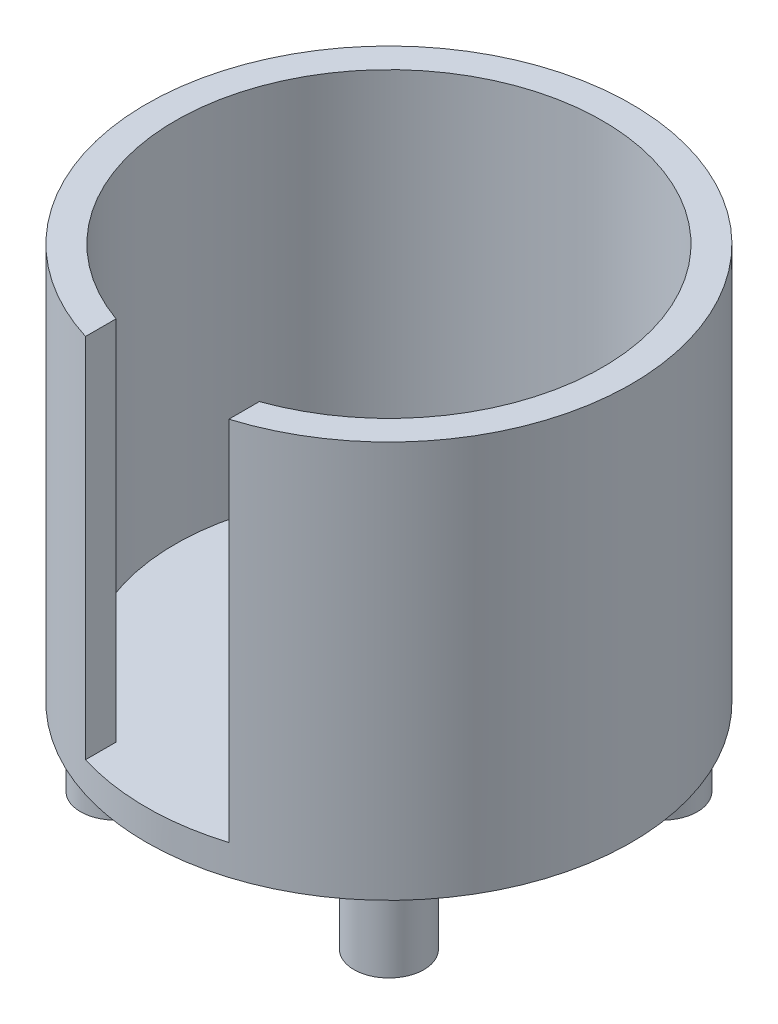
ISO-10303-21;
HEADER;
FILE_DESCRIPTION(('STEP AP214'),'2;1');
FILE_NAME('part.step','',(''),(''),'','','');
FILE_SCHEMA(('AUTOMOTIVE_DESIGN { 1 0 10303 214 1 1 1 1 }'));
ENDSEC;
DATA;
#1=APPLICATION_CONTEXT('core data for automotive mechanical design processes');
#2=APPLICATION_PROTOCOL_DEFINITION('international standard','automotive_design',2000,#1);
#3=PRODUCT_CONTEXT('',#1,'mechanical');
#4=PRODUCT('Part','Part','',(#3));
#5=PRODUCT_RELATED_PRODUCT_CATEGORY('part','',(#4));
#6=PRODUCT_DEFINITION_FORMATION('','',#4);
#7=PRODUCT_DEFINITION_CONTEXT('part definition',#1,'design');
#8=PRODUCT_DEFINITION('design','',#6,#7);
#9=PRODUCT_DEFINITION_SHAPE('','',#8);
#10=(LENGTH_UNIT() NAMED_UNIT(*) SI_UNIT(.MILLI.,.METRE.));
#11=(NAMED_UNIT(*) PLANE_ANGLE_UNIT() SI_UNIT($,.RADIAN.));
#12=(NAMED_UNIT(*) SI_UNIT($,.STERADIAN.) SOLID_ANGLE_UNIT());
#13=UNCERTAINTY_MEASURE_WITH_UNIT(LENGTH_MEASURE(1.E-05),#10,'distance_accuracy_value','');
#14=(GEOMETRIC_REPRESENTATION_CONTEXT(3) GLOBAL_UNCERTAINTY_ASSIGNED_CONTEXT((#13)) GLOBAL_UNIT_ASSIGNED_CONTEXT((#10,
#11,#12)) REPRESENTATION_CONTEXT('',''));
#15=CARTESIAN_POINT('',(0.,0.,0.));
#16=DIRECTION('',(0.,0.,1.));
#17=DIRECTION('',(1.,0.,0.));
#18=AXIS2_PLACEMENT_3D('',#15,#16,#17);
#19=CARTESIAN_POINT('',(0.,36.,0.));
#20=DIRECTION('',(0.,-1.,0.));
#21=DIRECTION('',(0.,0.,-1.));
#22=AXIS2_PLACEMENT_3D('',#19,#20,#21);
#23=CYLINDRICAL_SURFACE('',#22,22.);
#24=CARTESIAN_POINT('',(0.,2.75,0.));
#25=DIRECTION('',(0.,1.,0.));
#26=DIRECTION('',(0.,0.,1.));
#27=AXIS2_PLACEMENT_3D('',#24,#25,#26);
#28=CIRCLE('',#27,22.);
#29=CARTESIAN_POINT('',(-6.5,2.75,21.0178495569837));
#30=VERTEX_POINT('',#29);
#31=CARTESIAN_POINT('',(6.5,2.75,21.0178495569837));
#32=VERTEX_POINT('',#31);
#33=EDGE_CURVE('E228',#30,#32,#28,.T.);
#34=ORIENTED_EDGE('',*,*,#33,.F.);
#35=DIRECTION('',(0.,-1.,0.));
#36=VECTOR('',#35,1.);
#37=CARTESIAN_POINT('',(-6.5,36.,21.0178495569837));
#38=LINE('',#37,#36);
#39=CARTESIAN_POINT('',(-6.5,36.,21.0178495569837));
#40=VERTEX_POINT('',#39);
#41=EDGE_CURVE('E68',#30,#40,#38,.F.);
#42=ORIENTED_EDGE('',*,*,#41,.T.);
#43=CARTESIAN_POINT('',(0.,36.,0.));
#44=DIRECTION('',(0.,1.,0.));
#45=DIRECTION('',(0.,0.,1.));
#46=AXIS2_PLACEMENT_3D('',#43,#44,#45);
#47=CIRCLE('',#46,22.);
#48=CARTESIAN_POINT('',(6.5,36.,21.0178495569837));
#49=VERTEX_POINT('',#48);
#50=EDGE_CURVE('E103',#49,#40,#47,.T.);
#51=ORIENTED_EDGE('',*,*,#50,.F.);
#52=DIRECTION('',(0.,-1.,0.));
#53=VECTOR('',#52,1.);
#54=CARTESIAN_POINT('',(6.5,36.,21.0178495569837));
#55=LINE('',#54,#53);
#56=EDGE_CURVE('E86',#49,#32,#55,.T.);
#57=ORIENTED_EDGE('',*,*,#56,.T.);
#58=EDGE_LOOP('',(#34,#42,#51,#57));
#59=FACE_BOUND('',#58,.T.);
#60=CARTESIAN_POINT('',(0.,0.,0.));
#61=DIRECTION('',(0.,1.,0.));
#62=DIRECTION('',(0.,0.,1.));
#63=AXIS2_PLACEMENT_3D('',#60,#61,#62);
#64=CIRCLE('',#63,22.);
#65=CARTESIAN_POINT('',(0.,0.,22.));
#66=VERTEX_POINT('',#65);
#67=EDGE_CURVE('E113',#66,#66,#64,.T.);
#68=ORIENTED_EDGE('',*,*,#67,.T.);
#69=EDGE_LOOP('',(#68));
#70=FACE_BOUND('',#69,.T.);
#71=ADVANCED_FACE('F45',(#59,#70),#23,.T.);
#72=CARTESIAN_POINT('',(0.,36.,0.));
#73=DIRECTION('',(0.,1.,0.));
#74=DIRECTION('',(0.,0.,1.));
#75=AXIS2_PLACEMENT_3D('',#72,#73,#74);
#76=PLANE('',#75);
#77=DIRECTION('',(0.,0.,1.));
#78=VECTOR('',#77,1.);
#79=CARTESIAN_POINT('',(-6.5,36.,24.9538364962092));
#80=LINE('',#79,#78);
#81=CARTESIAN_POINT('',(-6.5,36.,18.2521402854569));
#82=VERTEX_POINT('',#81);
#83=EDGE_CURVE('E108',#82,#40,#80,.T.);
#84=ORIENTED_EDGE('',*,*,#83,.F.);
#85=CARTESIAN_POINT('',(0.,36.,0.));
#86=DIRECTION('',(0.,1.,0.));
#87=DIRECTION('',(0.,0.,1.));
#88=AXIS2_PLACEMENT_3D('',#85,#86,#87);
#89=CIRCLE('',#88,19.375);
#90=CARTESIAN_POINT('',(6.5,36.,18.2521402854569));
#91=VERTEX_POINT('',#90);
#92=EDGE_CURVE('E105',#91,#82,#89,.T.);
#93=ORIENTED_EDGE('',*,*,#92,.F.);
#94=DIRECTION('',(0.,0.,-1.));
#95=VECTOR('',#94,1.);
#96=CARTESIAN_POINT('',(6.5,36.,24.9538364962092));
#97=LINE('',#96,#95);
#98=EDGE_CURVE('E89',#49,#91,#97,.T.);
#99=ORIENTED_EDGE('',*,*,#98,.F.);
#100=ORIENTED_EDGE('',*,*,#50,.T.);
#101=EDGE_LOOP('',(#84,#93,#99,#100));
#102=FACE_BOUND('',#101,.T.);
#103=ADVANCED_FACE('F102',(#102),#76,.T.);
#104=CARTESIAN_POINT('',(0.,0.,0.));
#105=DIRECTION('',(0.,1.,0.));
#106=DIRECTION('',(0.,0.,1.));
#107=AXIS2_PLACEMENT_3D('',#104,#105,#106);
#108=PLANE('',#107);
#109=CARTESIAN_POINT('',(-12.386484201859,0.,-12.3882622442667));
#110=DIRECTION('',(0.,1.,0.));
#111=DIRECTION('',(0.,0.,1.));
#112=AXIS2_PLACEMENT_3D('',#109,#110,#111);
#113=CIRCLE('',#112,3.175);
#114=CARTESIAN_POINT('',(-12.386484201859,0.,-9.21326224426675));
#115=VERTEX_POINT('',#114);
#116=EDGE_CURVE('E11',#115,#115,#113,.F.);
#117=ORIENTED_EDGE('',*,*,#116,.F.);
#118=EDGE_LOOP('',(#117));
#119=FACE_BOUND('',#118,.T.);
#120=CARTESIAN_POINT('',(12.413515798141,0.,-12.3882622442666));
#121=DIRECTION('',(0.,1.,0.));
#122=DIRECTION('',(0.,0.,1.));
#123=AXIS2_PLACEMENT_3D('',#120,#121,#122);
#124=CIRCLE('',#123,3.175);
#125=CARTESIAN_POINT('',(12.413515798141,0.,-9.21326224426657));
#126=VERTEX_POINT('',#125);
#127=EDGE_CURVE('E53',#126,#126,#124,.F.);
#128=ORIENTED_EDGE('',*,*,#127,.F.);
#129=EDGE_LOOP('',(#128));
#130=FACE_BOUND('',#129,.T.);
#131=CARTESIAN_POINT('',(12.4135157981409,0.,12.4117377557334));
#132=DIRECTION('',(0.,1.,0.));
#133=DIRECTION('',(0.,0.,1.));
#134=AXIS2_PLACEMENT_3D('',#131,#132,#133);
#135=CIRCLE('',#134,3.175);
#136=CARTESIAN_POINT('',(12.4135157981409,0.,15.5867377557334));
#137=VERTEX_POINT('',#136);
#138=EDGE_CURVE('E118',#137,#137,#135,.F.);
#139=ORIENTED_EDGE('',*,*,#138,.F.);
#140=EDGE_LOOP('',(#139));
#141=FACE_BOUND('',#140,.T.);
#142=CARTESIAN_POINT('',(-12.3864842018591,0.,12.4117377557333));
#143=DIRECTION('',(0.,1.,0.));
#144=DIRECTION('',(0.,0.,1.));
#145=AXIS2_PLACEMENT_3D('',#142,#143,#144);
#146=CIRCLE('',#145,3.175);
#147=CARTESIAN_POINT('',(-12.3864842018591,0.,15.5867377557333));
#148=VERTEX_POINT('',#147);
#149=EDGE_CURVE('E112',#148,#148,#146,.F.);
#150=ORIENTED_EDGE('',*,*,#149,.F.);
#151=EDGE_LOOP('',(#150));
#152=FACE_BOUND('',#151,.T.);
#153=ORIENTED_EDGE('',*,*,#67,.F.);
#154=EDGE_LOOP('',(#153));
#155=FACE_BOUND('',#154,.T.);
#156=ADVANCED_FACE('F134',(#119,#130,#141,#152,#155),#108,.F.);
#157=CARTESIAN_POINT('',(0.,2.75,0.));
#158=DIRECTION('',(0.,1.,0.));
#159=DIRECTION('',(0.,0.,1.));
#160=AXIS2_PLACEMENT_3D('',#157,#158,#159);
#161=CYLINDRICAL_SURFACE('',#160,19.375);
#162=ORIENTED_EDGE('',*,*,#92,.T.);
#163=DIRECTION('',(0.,1.,0.));
#164=VECTOR('',#163,1.);
#165=CARTESIAN_POINT('',(-6.5,2.75,18.2521402854569));
#166=LINE('',#165,#164);
#167=CARTESIAN_POINT('',(-6.5,2.75,18.2521402854569));
#168=VERTEX_POINT('',#167);
#169=EDGE_CURVE('E95',#82,#168,#166,.F.);
#170=ORIENTED_EDGE('',*,*,#169,.T.);
#171=CARTESIAN_POINT('',(0.,2.75,0.));
#172=DIRECTION('',(0.,1.,0.));
#173=DIRECTION('',(0.,0.,1.));
#174=AXIS2_PLACEMENT_3D('',#171,#172,#173);
#175=CIRCLE('',#174,19.375);
#176=CARTESIAN_POINT('',(6.5,2.75,18.2521402854569));
#177=VERTEX_POINT('',#176);
#178=EDGE_CURVE('E121',#177,#168,#175,.T.);
#179=ORIENTED_EDGE('',*,*,#178,.F.);
#180=DIRECTION('',(0.,1.,0.));
#181=VECTOR('',#180,1.);
#182=CARTESIAN_POINT('',(6.5,2.75,18.2521402854569));
#183=LINE('',#182,#181);
#184=EDGE_CURVE('E96',#177,#91,#183,.T.);
#185=ORIENTED_EDGE('',*,*,#184,.T.);
#186=EDGE_LOOP('',(#162,#170,#179,#185));
#187=FACE_BOUND('',#186,.T.);
#188=ADVANCED_FACE('F137',(#187),#161,.F.);
#189=CARTESIAN_POINT('',(0.,2.75,0.));
#190=DIRECTION('',(0.,1.,0.));
#191=DIRECTION('',(0.,0.,1.));
#192=AXIS2_PLACEMENT_3D('',#189,#190,#191);
#193=PLANE('',#192);
#194=ORIENTED_EDGE('',*,*,#178,.T.);
#195=DIRECTION('',(0.,0.,1.));
#196=VECTOR('',#195,1.);
#197=CARTESIAN_POINT('',(-6.5,2.75,24.9538364962092));
#198=LINE('',#197,#196);
#199=EDGE_CURVE('E107',#168,#30,#198,.T.);
#200=ORIENTED_EDGE('',*,*,#199,.T.);
#201=ORIENTED_EDGE('',*,*,#33,.T.);
#202=DIRECTION('',(0.,0.,-1.));
#203=VECTOR('',#202,1.);
#204=CARTESIAN_POINT('',(6.5,2.75,24.9538364962092));
#205=LINE('',#204,#203);
#206=EDGE_CURVE('E60',#32,#177,#205,.T.);
#207=ORIENTED_EDGE('',*,*,#206,.T.);
#208=EDGE_LOOP('',(#194,#200,#201,#207));
#209=FACE_BOUND('',#208,.T.);
#210=ADVANCED_FACE('F154',(#209),#193,.T.);
#211=CARTESIAN_POINT('',(-6.5,2.75,24.9538364962092));
#212=DIRECTION('',(-1.,0.,0.));
#213=DIRECTION('',(0.,0.,1.));
#214=AXIS2_PLACEMENT_3D('',#211,#212,#213);
#215=PLANE('',#214);
#216=ORIENTED_EDGE('',*,*,#199,.F.);
#217=ORIENTED_EDGE('',*,*,#169,.F.);
#218=ORIENTED_EDGE('',*,*,#83,.T.);
#219=ORIENTED_EDGE('',*,*,#41,.F.);
#220=EDGE_LOOP('',(#216,#217,#218,#219));
#221=FACE_BOUND('',#220,.T.);
#222=ADVANCED_FACE('F158',(#221),#215,.F.);
#223=CARTESIAN_POINT('',(6.5,2.75,24.9538364962092));
#224=DIRECTION('',(1.,0.,0.));
#225=DIRECTION('',(0.,0.,-1.));
#226=AXIS2_PLACEMENT_3D('',#223,#224,#225);
#227=PLANE('',#226);
#228=ORIENTED_EDGE('',*,*,#98,.T.);
#229=ORIENTED_EDGE('',*,*,#184,.F.);
#230=ORIENTED_EDGE('',*,*,#206,.F.);
#231=ORIENTED_EDGE('',*,*,#56,.F.);
#232=EDGE_LOOP('',(#228,#229,#230,#231));
#233=FACE_BOUND('',#232,.T.);
#234=ADVANCED_FACE('F88',(#233),#227,.F.);
#235=CARTESIAN_POINT('',(-12.3864842018591,-7.,12.4117377557333));
#236=DIRECTION('',(0.,1.,0.));
#237=DIRECTION('',(0.,0.,1.));
#238=AXIS2_PLACEMENT_3D('',#235,#236,#237);
#239=CYLINDRICAL_SURFACE('',#238,3.175);
#240=CARTESIAN_POINT('',(-12.3864842018591,-7.,12.4117377557333));
#241=DIRECTION('',(0.,-1.,0.));
#242=DIRECTION('',(0.,0.,-1.));
#243=AXIS2_PLACEMENT_3D('',#240,#241,#242);
#244=CIRCLE('',#243,3.175);
#245=CARTESIAN_POINT('',(-12.3864842018591,-7.,9.23673775573325));
#246=VERTEX_POINT('',#245);
#247=EDGE_CURVE('E211',#246,#246,#244,.T.);
#248=ORIENTED_EDGE('',*,*,#247,.F.);
#249=EDGE_LOOP('',(#248));
#250=FACE_BOUND('',#249,.T.);
#251=ORIENTED_EDGE('',*,*,#149,.T.);
#252=EDGE_LOOP('',(#251));
#253=FACE_BOUND('',#252,.T.);
#254=ADVANCED_FACE('F163',(#250,#253),#239,.T.);
#255=CARTESIAN_POINT('',(-12.3864842018591,-7.,12.4117377557333));
#256=DIRECTION('',(0.,-1.,0.));
#257=DIRECTION('',(0.,0.,-1.));
#258=AXIS2_PLACEMENT_3D('',#255,#256,#257);
#259=PLANE('',#258);
#260=ORIENTED_EDGE('',*,*,#247,.T.);
#261=EDGE_LOOP('',(#260));
#262=FACE_BOUND('',#261,.T.);
#263=ADVANCED_FACE('F166',(#262),#259,.T.);
#264=CARTESIAN_POINT('',(12.4135157981409,-7.,12.4117377557334));
#265=DIRECTION('',(0.,1.,0.));
#266=DIRECTION('',(0.,0.,1.));
#267=AXIS2_PLACEMENT_3D('',#264,#265,#266);
#268=CYLINDRICAL_SURFACE('',#267,3.175);
#269=CARTESIAN_POINT('',(12.4135157981409,-7.,12.4117377557334));
#270=DIRECTION('',(0.,-1.,0.));
#271=DIRECTION('',(0.,0.,-1.));
#272=AXIS2_PLACEMENT_3D('',#269,#270,#271);
#273=CIRCLE('',#272,3.175);
#274=CARTESIAN_POINT('',(12.4135157981409,-7.,9.23673775573342));
#275=VERTEX_POINT('',#274);
#276=EDGE_CURVE('E205',#275,#275,#273,.T.);
#277=ORIENTED_EDGE('',*,*,#276,.F.);
#278=EDGE_LOOP('',(#277));
#279=FACE_BOUND('',#278,.T.);
#280=ORIENTED_EDGE('',*,*,#138,.T.);
#281=EDGE_LOOP('',(#280));
#282=FACE_BOUND('',#281,.T.);
#283=ADVANCED_FACE('F170',(#279,#282),#268,.T.);
#284=CARTESIAN_POINT('',(12.4135157981409,-7.,12.4117377557334));
#285=DIRECTION('',(0.,-1.,0.));
#286=DIRECTION('',(0.,0.,-1.));
#287=AXIS2_PLACEMENT_3D('',#284,#285,#286);
#288=PLANE('',#287);
#289=ORIENTED_EDGE('',*,*,#276,.T.);
#290=EDGE_LOOP('',(#289));
#291=FACE_BOUND('',#290,.T.);
#292=ADVANCED_FACE('F172',(#291),#288,.T.);
#293=CARTESIAN_POINT('',(12.413515798141,-7.,-12.3882622442666));
#294=DIRECTION('',(0.,1.,0.));
#295=DIRECTION('',(0.,0.,1.));
#296=AXIS2_PLACEMENT_3D('',#293,#294,#295);
#297=CYLINDRICAL_SURFACE('',#296,3.175);
#298=CARTESIAN_POINT('',(12.413515798141,-7.,-12.3882622442666));
#299=DIRECTION('',(0.,-1.,0.));
#300=DIRECTION('',(0.,0.,-1.));
#301=AXIS2_PLACEMENT_3D('',#298,#299,#300);
#302=CIRCLE('',#301,3.175);
#303=CARTESIAN_POINT('',(12.413515798141,-7.,-15.5632622442666));
#304=VERTEX_POINT('',#303);
#305=EDGE_CURVE('E201',#304,#304,#302,.T.);
#306=ORIENTED_EDGE('',*,*,#305,.F.);
#307=EDGE_LOOP('',(#306));
#308=FACE_BOUND('',#307,.T.);
#309=ORIENTED_EDGE('',*,*,#127,.T.);
#310=EDGE_LOOP('',(#309));
#311=FACE_BOUND('',#310,.T.);
#312=ADVANCED_FACE('F132',(#308,#311),#297,.T.);
#313=CARTESIAN_POINT('',(12.413515798141,-7.,-12.3882622442666));
#314=DIRECTION('',(0.,-1.,0.));
#315=DIRECTION('',(0.,0.,-1.));
#316=AXIS2_PLACEMENT_3D('',#313,#314,#315);
#317=PLANE('',#316);
#318=ORIENTED_EDGE('',*,*,#305,.T.);
#319=EDGE_LOOP('',(#318));
#320=FACE_BOUND('',#319,.T.);
#321=ADVANCED_FACE('F179',(#320),#317,.T.);
#322=CARTESIAN_POINT('',(-12.386484201859,-7.,-12.3882622442667));
#323=DIRECTION('',(0.,1.,0.));
#324=DIRECTION('',(0.,0.,1.));
#325=AXIS2_PLACEMENT_3D('',#322,#323,#324);
#326=CYLINDRICAL_SURFACE('',#325,3.175);
#327=CARTESIAN_POINT('',(-12.386484201859,-7.,-12.3882622442667));
#328=DIRECTION('',(0.,-1.,0.));
#329=DIRECTION('',(0.,0.,-1.));
#330=AXIS2_PLACEMENT_3D('',#327,#328,#329);
#331=CIRCLE('',#330,3.175);
#332=CARTESIAN_POINT('',(-12.386484201859,-7.,-15.5632622442667));
#333=VERTEX_POINT('',#332);
#334=EDGE_CURVE('E198',#333,#333,#331,.T.);
#335=ORIENTED_EDGE('',*,*,#334,.F.);
#336=EDGE_LOOP('',(#335));
#337=FACE_BOUND('',#336,.T.);
#338=ORIENTED_EDGE('',*,*,#116,.T.);
#339=EDGE_LOOP('',(#338));
#340=FACE_BOUND('',#339,.T.);
#341=ADVANCED_FACE('F182',(#337,#340),#326,.T.);
#342=CARTESIAN_POINT('',(-12.386484201859,-7.,-12.3882622442667));
#343=DIRECTION('',(0.,-1.,0.));
#344=DIRECTION('',(0.,0.,-1.));
#345=AXIS2_PLACEMENT_3D('',#342,#343,#344);
#346=PLANE('',#345);
#347=ORIENTED_EDGE('',*,*,#334,.T.);
#348=EDGE_LOOP('',(#347));
#349=FACE_BOUND('',#348,.T.);
#350=ADVANCED_FACE('F187',(#349),#346,.T.);
#351=CLOSED_SHELL('',(#71,#103,#156,#188,#210,#222,#234,#254,#263,#283,#292,#312,#321,#341,#350));
#352=MANIFOLD_SOLID_BREP('B2',#351);
#353=ADVANCED_BREP_SHAPE_REPRESENTATION('',(#18,#352),#14);
#354=SHAPE_DEFINITION_REPRESENTATION(#9,#353);
ENDSEC;
END-ISO-10303-21;
